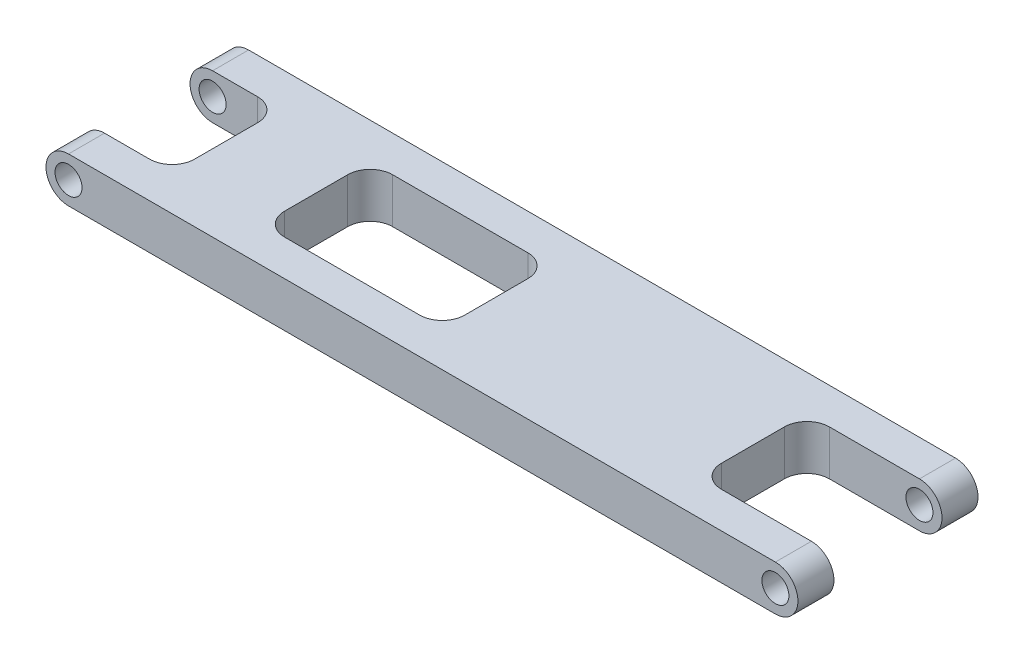
ISO-10303-21;
HEADER;
FILE_DESCRIPTION(('STEP AP214'),'2;1');
FILE_NAME('part.step','',(''),(''),'','','');
FILE_SCHEMA(('AUTOMOTIVE_DESIGN { 1 0 10303 214 1 1 1 1 }'));
ENDSEC;
DATA;
#1=APPLICATION_CONTEXT('core data for automotive mechanical design processes');
#2=APPLICATION_PROTOCOL_DEFINITION('international standard','automotive_design',2000,#1);
#3=PRODUCT_CONTEXT('',#1,'mechanical');
#4=PRODUCT('Part','Part','',(#3));
#5=PRODUCT_RELATED_PRODUCT_CATEGORY('part','',(#4));
#6=PRODUCT_DEFINITION_FORMATION('','',#4);
#7=PRODUCT_DEFINITION_CONTEXT('part definition',#1,'design');
#8=PRODUCT_DEFINITION('design','',#6,#7);
#9=PRODUCT_DEFINITION_SHAPE('','',#8);
#10=(LENGTH_UNIT() NAMED_UNIT(*) SI_UNIT(.MILLI.,.METRE.));
#11=(NAMED_UNIT(*) PLANE_ANGLE_UNIT() SI_UNIT($,.RADIAN.));
#12=(NAMED_UNIT(*) SI_UNIT($,.STERADIAN.) SOLID_ANGLE_UNIT());
#13=UNCERTAINTY_MEASURE_WITH_UNIT(LENGTH_MEASURE(1.E-05),#10,'distance_accuracy_value','');
#14=(GEOMETRIC_REPRESENTATION_CONTEXT(3) GLOBAL_UNCERTAINTY_ASSIGNED_CONTEXT((#13)) GLOBAL_UNIT_ASSIGNED_CONTEXT((#10,
#11,#12)) REPRESENTATION_CONTEXT('',''));
#15=CARTESIAN_POINT('',(0.,0.,0.));
#16=DIRECTION('',(0.,0.,1.));
#17=DIRECTION('',(1.,0.,0.));
#18=AXIS2_PLACEMENT_3D('',#15,#16,#17);
#19=CARTESIAN_POINT('',(0.,28.,10.));
#20=DIRECTION('',(0.,0.,-1.));
#21=DIRECTION('',(-1.,0.,0.));
#22=AXIS2_PLACEMENT_3D('',#19,#20,#21);
#23=CYLINDRICAL_SURFACE('',#22,2.5);
#24=CARTESIAN_POINT('',(0.,28.,6.));
#25=DIRECTION('',(0.,0.,-1.));
#26=DIRECTION('',(-1.,0.,0.));
#27=AXIS2_PLACEMENT_3D('',#24,#25,#26);
#28=CIRCLE('',#27,2.5);
#29=CARTESIAN_POINT('',(0.,25.5,6.));
#30=VERTEX_POINT('',#29);
#31=CARTESIAN_POINT('',(0.,30.5,6.));
#32=VERTEX_POINT('',#31);
#33=EDGE_CURVE('E210',#30,#32,#28,.T.);
#34=ORIENTED_EDGE('',*,*,#33,.F.);
#35=DIRECTION('',(0.,0.,-1.));
#36=VECTOR('',#35,1.);
#37=CARTESIAN_POINT('',(0.,25.5,10.));
#38=LINE('',#37,#36);
#39=CARTESIAN_POINT('',(0.,25.5,10.));
#40=VERTEX_POINT('',#39);
#41=EDGE_CURVE('E11',#40,#30,#38,.T.);
#42=ORIENTED_EDGE('',*,*,#41,.F.);
#43=CARTESIAN_POINT('',(0.,28.,10.));
#44=DIRECTION('',(0.,0.,1.));
#45=DIRECTION('',(1.,0.,0.));
#46=AXIS2_PLACEMENT_3D('',#43,#44,#45);
#47=CIRCLE('',#46,2.5);
#48=CARTESIAN_POINT('',(0.,30.5,10.));
#49=VERTEX_POINT('',#48);
#50=EDGE_CURVE('E368',#49,#40,#47,.T.);
#51=ORIENTED_EDGE('',*,*,#50,.F.);
#52=DIRECTION('',(0.,0.,-1.));
#53=VECTOR('',#52,1.);
#54=CARTESIAN_POINT('',(0.,30.5,10.));
#55=LINE('',#54,#53);
#56=EDGE_CURVE('E389',#49,#32,#55,.T.);
#57=ORIENTED_EDGE('',*,*,#56,.T.);
#58=EDGE_LOOP('',(#34,#42,#51,#57));
#59=FACE_BOUND('',#58,.T.);
#60=ADVANCED_FACE('F41',(#59),#23,.T.);
#61=CARTESIAN_POINT('',(0.,28.,-6.));
#62=DIRECTION('',(0.,0.,1.));
#63=DIRECTION('',(1.,0.,0.));
#64=AXIS2_PLACEMENT_3D('',#61,#62,#63);
#65=CIRCLE('',#64,2.5);
#66=CARTESIAN_POINT('',(0.,30.5,-6.));
#67=VERTEX_POINT('',#66);
#68=CARTESIAN_POINT('',(0.,25.5,-6.));
#69=VERTEX_POINT('',#68);
#70=EDGE_CURVE('E323',#67,#69,#65,.T.);
#71=ORIENTED_EDGE('',*,*,#70,.F.);
#72=CARTESIAN_POINT('',(0.,30.5,-10.));
#73=VERTEX_POINT('',#72);
#74=EDGE_CURVE('E378',#67,#73,#55,.T.);
#75=ORIENTED_EDGE('',*,*,#74,.T.);
#76=CARTESIAN_POINT('',(0.,28.,-10.));
#77=DIRECTION('',(0.,0.,1.));
#78=DIRECTION('',(1.,0.,0.));
#79=AXIS2_PLACEMENT_3D('',#76,#77,#78);
#80=CIRCLE('',#79,2.5);
#81=CARTESIAN_POINT('',(0.,25.5,-10.));
#82=VERTEX_POINT('',#81);
#83=EDGE_CURVE('E365',#73,#82,#80,.T.);
#84=ORIENTED_EDGE('',*,*,#83,.T.);
#85=EDGE_CURVE('E49',#69,#82,#38,.T.);
#86=ORIENTED_EDGE('',*,*,#85,.F.);
#87=EDGE_LOOP('',(#71,#75,#84,#86));
#88=FACE_BOUND('',#87,.T.);
#89=ADVANCED_FACE('F423',(#88),#23,.T.);
#90=CARTESIAN_POINT('',(0.,25.5,10.));
#91=DIRECTION('',(0.,1.,0.));
#92=DIRECTION('',(0.,0.,1.));
#93=AXIS2_PLACEMENT_3D('',#90,#91,#92);
#94=PLANE('',#93);
#95=CARTESIAN_POINT('',(35.,25.5,3.49999999999999));
#96=DIRECTION('',(0.,1.,0.));
#97=DIRECTION('',(0.,0.,1.));
#98=AXIS2_PLACEMENT_3D('',#95,#96,#97);
#99=CIRCLE('',#98,2.5);
#100=CARTESIAN_POINT('',(37.5,25.5,3.49999999999999));
#101=VERTEX_POINT('',#100);
#102=CARTESIAN_POINT('',(35.,25.5,5.99999999999999));
#103=VERTEX_POINT('',#102);
#104=EDGE_CURVE('E342',#101,#103,#99,.F.);
#105=ORIENTED_EDGE('',*,*,#104,.F.);
#106=DIRECTION('',(0.,0.,1.));
#107=VECTOR('',#106,1.);
#108=CARTESIAN_POINT('',(37.5,25.5,10.));
#109=LINE('',#108,#107);
#110=CARTESIAN_POINT('',(37.5,25.5,-3.50000000000001));
#111=VERTEX_POINT('',#110);
#112=EDGE_CURVE('E340',#111,#101,#109,.T.);
#113=ORIENTED_EDGE('',*,*,#112,.F.);
#114=CARTESIAN_POINT('',(35.,25.5,-3.5));
#115=DIRECTION('',(0.,1.,0.));
#116=DIRECTION('',(0.,0.,1.));
#117=AXIS2_PLACEMENT_3D('',#114,#115,#116);
#118=CIRCLE('',#117,2.5);
#119=CARTESIAN_POINT('',(35.,25.5,-6.));
#120=VERTEX_POINT('',#119);
#121=EDGE_CURVE('E338',#120,#111,#118,.F.);
#122=ORIENTED_EDGE('',*,*,#121,.F.);
#123=DIRECTION('',(1.,0.,0.));
#124=VECTOR('',#123,1.);
#125=CARTESIAN_POINT('',(0.,25.5,-6.00000000000001));
#126=LINE('',#125,#124);
#127=CARTESIAN_POINT('',(20.,25.5,-6.));
#128=VERTEX_POINT('',#127);
#129=EDGE_CURVE('E336',#128,#120,#126,.T.);
#130=ORIENTED_EDGE('',*,*,#129,.F.);
#131=CARTESIAN_POINT('',(20.,25.5,-3.5));
#132=DIRECTION('',(0.,1.,0.));
#133=DIRECTION('',(0.,0.,1.));
#134=AXIS2_PLACEMENT_3D('',#131,#132,#133);
#135=CIRCLE('',#134,2.5);
#136=CARTESIAN_POINT('',(17.5,25.5,-3.5));
#137=VERTEX_POINT('',#136);
#138=EDGE_CURVE('E334',#137,#128,#135,.F.);
#139=ORIENTED_EDGE('',*,*,#138,.F.);
#140=DIRECTION('',(0.,0.,-1.));
#141=VECTOR('',#140,1.);
#142=CARTESIAN_POINT('',(17.5,25.5,9.99999999999999));
#143=LINE('',#142,#141);
#144=CARTESIAN_POINT('',(17.5,25.5,3.49999999999999));
#145=VERTEX_POINT('',#144);
#146=EDGE_CURVE('E332',#145,#137,#143,.T.);
#147=ORIENTED_EDGE('',*,*,#146,.F.);
#148=CARTESIAN_POINT('',(20.,25.5,3.49999999999999));
#149=DIRECTION('',(0.,1.,0.));
#150=DIRECTION('',(0.,0.,1.));
#151=AXIS2_PLACEMENT_3D('',#148,#149,#150);
#152=CIRCLE('',#151,2.5);
#153=CARTESIAN_POINT('',(20.,25.5,5.99999999999999));
#154=VERTEX_POINT('',#153);
#155=EDGE_CURVE('E330',#154,#145,#152,.F.);
#156=ORIENTED_EDGE('',*,*,#155,.F.);
#157=DIRECTION('',(-1.,0.,0.));
#158=VECTOR('',#157,1.);
#159=CARTESIAN_POINT('',(0.,25.5,5.99999999999999));
#160=LINE('',#159,#158);
#161=EDGE_CURVE('E328',#103,#154,#160,.T.);
#162=ORIENTED_EDGE('',*,*,#161,.F.);
#163=EDGE_LOOP('',(#105,#113,#122,#130,#139,#147,#156,#162));
#164=FACE_BOUND('',#163,.T.);
#165=DIRECTION('',(-1.,0.,0.));
#166=VECTOR('',#165,1.);
#167=CARTESIAN_POINT('',(0.,25.5,6.));
#168=LINE('',#167,#166);
#169=CARTESIAN_POINT('',(5.,25.5,6.));
#170=VERTEX_POINT('',#169);
#171=EDGE_CURVE('E325',#170,#30,#168,.T.);
#172=ORIENTED_EDGE('',*,*,#171,.F.);
#173=CARTESIAN_POINT('',(5.,25.5,3.5));
#174=DIRECTION('',(0.,1.,0.));
#175=DIRECTION('',(0.,0.,1.));
#176=AXIS2_PLACEMENT_3D('',#173,#174,#175);
#177=CIRCLE('',#176,2.5);
#178=CARTESIAN_POINT('',(7.5,25.5,3.5));
#179=VERTEX_POINT('',#178);
#180=EDGE_CURVE('E224',#179,#170,#177,.F.);
#181=ORIENTED_EDGE('',*,*,#180,.F.);
#182=DIRECTION('',(0.,0.,1.));
#183=VECTOR('',#182,1.);
#184=CARTESIAN_POINT('',(7.5,25.5,10.));
#185=LINE('',#184,#183);
#186=CARTESIAN_POINT('',(7.5,25.5,-3.5));
#187=VERTEX_POINT('',#186);
#188=EDGE_CURVE('E352',#187,#179,#185,.T.);
#189=ORIENTED_EDGE('',*,*,#188,.F.);
#190=CARTESIAN_POINT('',(5.,25.5,-3.5));
#191=DIRECTION('',(0.,1.,0.));
#192=DIRECTION('',(0.,0.,1.));
#193=AXIS2_PLACEMENT_3D('',#190,#191,#192);
#194=CIRCLE('',#193,2.5);
#195=CARTESIAN_POINT('',(5.,25.5,-6.));
#196=VERTEX_POINT('',#195);
#197=EDGE_CURVE('E350',#196,#187,#194,.F.);
#198=ORIENTED_EDGE('',*,*,#197,.F.);
#199=DIRECTION('',(1.,0.,0.));
#200=VECTOR('',#199,1.);
#201=CARTESIAN_POINT('',(0.,25.5,-6.));
#202=LINE('',#201,#200);
#203=EDGE_CURVE('E321',#69,#196,#202,.T.);
#204=ORIENTED_EDGE('',*,*,#203,.F.);
#205=ORIENTED_EDGE('',*,*,#85,.T.);
#206=DIRECTION('',(1.,0.,0.));
#207=VECTOR('',#206,1.);
#208=CARTESIAN_POINT('',(0.,25.5,-10.));
#209=LINE('',#208,#207);
#210=CARTESIAN_POINT('',(78.5,25.5,-10.));
#211=VERTEX_POINT('',#210);
#212=EDGE_CURVE('E381',#82,#211,#209,.T.);
#213=ORIENTED_EDGE('',*,*,#212,.T.);
#214=DIRECTION('',(0.,0.,-1.));
#215=VECTOR('',#214,1.);
#216=CARTESIAN_POINT('',(78.5,25.5,10.));
#217=LINE('',#216,#215);
#218=CARTESIAN_POINT('',(78.5,25.5,-5.99999999999998));
#219=VERTEX_POINT('',#218);
#220=EDGE_CURVE('E395',#219,#211,#217,.T.);
#221=ORIENTED_EDGE('',*,*,#220,.F.);
#222=DIRECTION('',(1.,0.,0.));
#223=VECTOR('',#222,1.);
#224=CARTESIAN_POINT('',(0.,25.5,-6.00000000000023));
#225=LINE('',#224,#223);
#226=CARTESIAN_POINT('',(68.5,25.5,-6.00000000000002));
#227=VERTEX_POINT('',#226);
#228=EDGE_CURVE('E318',#227,#219,#225,.T.);
#229=ORIENTED_EDGE('',*,*,#228,.F.);
#230=CARTESIAN_POINT('',(68.5,25.5,-3.50000000000002));
#231=DIRECTION('',(0.,1.,0.));
#232=DIRECTION('',(0.,0.,1.));
#233=AXIS2_PLACEMENT_3D('',#230,#231,#232);
#234=CIRCLE('',#233,2.5);
#235=CARTESIAN_POINT('',(66.,25.5,-3.50000000000002));
#236=VERTEX_POINT('',#235);
#237=EDGE_CURVE('E348',#236,#227,#234,.F.);
#238=ORIENTED_EDGE('',*,*,#237,.F.);
#239=DIRECTION('',(0.,0.,-1.));
#240=VECTOR('',#239,1.);
#241=CARTESIAN_POINT('',(66.,25.5,10.));
#242=LINE('',#241,#240);
#243=CARTESIAN_POINT('',(66.,25.5,3.50000000000002));
#244=VERTEX_POINT('',#243);
#245=EDGE_CURVE('E346',#244,#236,#242,.T.);
#246=ORIENTED_EDGE('',*,*,#245,.F.);
#247=CARTESIAN_POINT('',(68.5,25.5,3.50000000000002));
#248=DIRECTION('',(0.,1.,0.));
#249=DIRECTION('',(0.,0.,1.));
#250=AXIS2_PLACEMENT_3D('',#247,#248,#249);
#251=CIRCLE('',#250,2.5);
#252=CARTESIAN_POINT('',(68.5,25.5,6.00000000000002));
#253=VERTEX_POINT('',#252);
#254=EDGE_CURVE('E344',#253,#244,#251,.F.);
#255=ORIENTED_EDGE('',*,*,#254,.F.);
#256=DIRECTION('',(-1.,0.,0.));
#257=VECTOR('',#256,1.);
#258=CARTESIAN_POINT('',(0.,25.5,6.00000000000023));
#259=LINE('',#258,#257);
#260=CARTESIAN_POINT('',(78.5,25.5,5.99999999999999));
#261=VERTEX_POINT('',#260);
#262=EDGE_CURVE('E313',#261,#253,#259,.T.);
#263=ORIENTED_EDGE('',*,*,#262,.F.);
#264=CARTESIAN_POINT('',(78.5,25.5,10.));
#265=VERTEX_POINT('',#264);
#266=EDGE_CURVE('E396',#265,#261,#217,.T.);
#267=ORIENTED_EDGE('',*,*,#266,.F.);
#268=DIRECTION('',(1.,0.,0.));
#269=VECTOR('',#268,1.);
#270=CARTESIAN_POINT('',(0.,25.5,10.));
#271=LINE('',#270,#269);
#272=EDGE_CURVE('E371',#40,#265,#271,.T.);
#273=ORIENTED_EDGE('',*,*,#272,.F.);
#274=ORIENTED_EDGE('',*,*,#41,.T.);
#275=EDGE_LOOP('',(#172,#181,#189,#198,#204,#205,#213,#221,#229,#238,#246,#255,#263,#267,#273,#274));
#276=FACE_BOUND('',#275,.T.);
#277=ADVANCED_FACE('F420',(#164,#276),#94,.F.);
#278=CARTESIAN_POINT('',(78.5,28.,10.));
#279=DIRECTION('',(0.,0.,-1.));
#280=DIRECTION('',(-1.,0.,0.));
#281=AXIS2_PLACEMENT_3D('',#278,#279,#280);
#282=CYLINDRICAL_SURFACE('',#281,2.5);
#283=DIRECTION('',(0.,0.,-1.));
#284=VECTOR('',#283,1.);
#285=CARTESIAN_POINT('',(78.5,30.5,10.));
#286=LINE('',#285,#284);
#287=CARTESIAN_POINT('',(78.5,30.5,-5.99999999999999));
#288=VERTEX_POINT('',#287);
#289=CARTESIAN_POINT('',(78.5,30.5,-10.));
#290=VERTEX_POINT('',#289);
#291=EDGE_CURVE('E391',#288,#290,#286,.T.);
#292=ORIENTED_EDGE('',*,*,#291,.F.);
#293=CARTESIAN_POINT('',(78.5,28.,-5.99999999999998));
#294=DIRECTION('',(0.,0.,1.));
#295=DIRECTION('',(1.,0.,0.));
#296=AXIS2_PLACEMENT_3D('',#293,#294,#295);
#297=CIRCLE('',#296,2.5);
#298=EDGE_CURVE('E316',#219,#288,#297,.T.);
#299=ORIENTED_EDGE('',*,*,#298,.F.);
#300=ORIENTED_EDGE('',*,*,#220,.T.);
#301=CARTESIAN_POINT('',(78.5,28.,-10.));
#302=DIRECTION('',(0.,0.,1.));
#303=DIRECTION('',(1.,0.,0.));
#304=AXIS2_PLACEMENT_3D('',#301,#302,#303);
#305=CIRCLE('',#304,2.5);
#306=EDGE_CURVE('E384',#211,#290,#305,.T.);
#307=ORIENTED_EDGE('',*,*,#306,.T.);
#308=EDGE_LOOP('',(#292,#299,#300,#307));
#309=FACE_BOUND('',#308,.T.);
#310=ADVANCED_FACE('F436',(#309),#282,.T.);
#311=CARTESIAN_POINT('',(78.5,28.,5.99999999999999));
#312=DIRECTION('',(0.,0.,-1.));
#313=DIRECTION('',(-1.,0.,0.));
#314=AXIS2_PLACEMENT_3D('',#311,#312,#313);
#315=CIRCLE('',#314,2.5);
#316=CARTESIAN_POINT('',(78.5,30.5,5.99999999999999));
#317=VERTEX_POINT('',#316);
#318=EDGE_CURVE('E311',#317,#261,#315,.T.);
#319=ORIENTED_EDGE('',*,*,#318,.F.);
#320=CARTESIAN_POINT('',(78.5,30.5,10.));
#321=VERTEX_POINT('',#320);
#322=EDGE_CURVE('E392',#321,#317,#286,.T.);
#323=ORIENTED_EDGE('',*,*,#322,.F.);
#324=CARTESIAN_POINT('',(78.5,28.,10.));
#325=DIRECTION('',(0.,0.,1.));
#326=DIRECTION('',(1.,0.,0.));
#327=AXIS2_PLACEMENT_3D('',#324,#325,#326);
#328=CIRCLE('',#327,2.5);
#329=EDGE_CURVE('E374',#265,#321,#328,.T.);
#330=ORIENTED_EDGE('',*,*,#329,.F.);
#331=ORIENTED_EDGE('',*,*,#266,.T.);
#332=EDGE_LOOP('',(#319,#323,#330,#331));
#333=FACE_BOUND('',#332,.T.);
#334=ADVANCED_FACE('F461',(#333),#282,.T.);
#335=CARTESIAN_POINT('',(0.,30.5,10.));
#336=DIRECTION('',(0.,-1.,0.));
#337=DIRECTION('',(0.,0.,-1.));
#338=AXIS2_PLACEMENT_3D('',#335,#336,#337);
#339=PLANE('',#338);
#340=CARTESIAN_POINT('',(35.,30.5,3.49999999999999));
#341=DIRECTION('',(0.,1.,0.));
#342=DIRECTION('',(0.,0.,1.));
#343=AXIS2_PLACEMENT_3D('',#340,#341,#342);
#344=CIRCLE('',#343,2.5);
#345=CARTESIAN_POINT('',(35.,30.5,5.99999999999999));
#346=VERTEX_POINT('',#345);
#347=CARTESIAN_POINT('',(37.5,30.5,3.49999999999999));
#348=VERTEX_POINT('',#347);
#349=EDGE_CURVE('E247',#346,#348,#344,.T.);
#350=ORIENTED_EDGE('',*,*,#349,.F.);
#351=DIRECTION('',(1.,0.,0.));
#352=VECTOR('',#351,1.);
#353=CARTESIAN_POINT('',(20.,30.5,5.99999999999999));
#354=LINE('',#353,#352);
#355=CARTESIAN_POINT('',(20.,30.5,5.99999999999999));
#356=VERTEX_POINT('',#355);
#357=EDGE_CURVE('E290',#356,#346,#354,.T.);
#358=ORIENTED_EDGE('',*,*,#357,.F.);
#359=CARTESIAN_POINT('',(20.,30.5,3.49999999999999));
#360=DIRECTION('',(0.,1.,0.));
#361=DIRECTION('',(0.,0.,1.));
#362=AXIS2_PLACEMENT_3D('',#359,#360,#361);
#363=CIRCLE('',#362,2.5);
#364=CARTESIAN_POINT('',(17.5,30.5,3.49999999999999));
#365=VERTEX_POINT('',#364);
#366=EDGE_CURVE('E292',#365,#356,#363,.T.);
#367=ORIENTED_EDGE('',*,*,#366,.F.);
#368=DIRECTION('',(0.,0.,1.));
#369=VECTOR('',#368,1.);
#370=CARTESIAN_POINT('',(17.5,30.5,-3.5));
#371=LINE('',#370,#369);
#372=CARTESIAN_POINT('',(17.5,30.5,-3.5));
#373=VERTEX_POINT('',#372);
#374=EDGE_CURVE('E294',#373,#365,#371,.T.);
#375=ORIENTED_EDGE('',*,*,#374,.F.);
#376=CARTESIAN_POINT('',(20.,30.5,-3.5));
#377=DIRECTION('',(0.,1.,0.));
#378=DIRECTION('',(0.,0.,1.));
#379=AXIS2_PLACEMENT_3D('',#376,#377,#378);
#380=CIRCLE('',#379,2.5);
#381=CARTESIAN_POINT('',(20.,30.5,-6.));
#382=VERTEX_POINT('',#381);
#383=EDGE_CURVE('E297',#382,#373,#380,.T.);
#384=ORIENTED_EDGE('',*,*,#383,.F.);
#385=DIRECTION('',(-1.,0.,0.));
#386=VECTOR('',#385,1.);
#387=CARTESIAN_POINT('',(20.,30.5,-6.));
#388=LINE('',#387,#386);
#389=CARTESIAN_POINT('',(35.,30.5,-6.));
#390=VERTEX_POINT('',#389);
#391=EDGE_CURVE('E300',#390,#382,#388,.T.);
#392=ORIENTED_EDGE('',*,*,#391,.F.);
#393=CARTESIAN_POINT('',(35.,30.5,-3.5));
#394=DIRECTION('',(0.,1.,0.));
#395=DIRECTION('',(0.,0.,-1.));
#396=AXIS2_PLACEMENT_3D('',#393,#394,#395);
#397=CIRCLE('',#396,2.5);
#398=CARTESIAN_POINT('',(37.5,30.5,-3.50000000000001));
#399=VERTEX_POINT('',#398);
#400=EDGE_CURVE('E303',#399,#390,#397,.T.);
#401=ORIENTED_EDGE('',*,*,#400,.F.);
#402=DIRECTION('',(0.,0.,-1.));
#403=VECTOR('',#402,1.);
#404=CARTESIAN_POINT('',(37.5,30.5,-3.5));
#405=LINE('',#404,#403);
#406=EDGE_CURVE('E306',#348,#399,#405,.T.);
#407=ORIENTED_EDGE('',*,*,#406,.F.);
#408=EDGE_LOOP('',(#350,#358,#367,#375,#384,#392,#401,#407));
#409=FACE_BOUND('',#408,.T.);
#410=DIRECTION('',(1.,0.,0.));
#411=VECTOR('',#410,1.);
#412=CARTESIAN_POINT('',(-2.5,30.5,6.));
#413=LINE('',#412,#411);
#414=CARTESIAN_POINT('',(5.,30.5,6.));
#415=VERTEX_POINT('',#414);
#416=EDGE_CURVE('E204',#32,#415,#413,.T.);
#417=ORIENTED_EDGE('',*,*,#416,.F.);
#418=ORIENTED_EDGE('',*,*,#56,.F.);
#419=DIRECTION('',(-1.,0.,0.));
#420=VECTOR('',#419,1.);
#421=CARTESIAN_POINT('',(0.,30.5,10.));
#422=LINE('',#421,#420);
#423=EDGE_CURVE('E376',#321,#49,#422,.T.);
#424=ORIENTED_EDGE('',*,*,#423,.F.);
#425=ORIENTED_EDGE('',*,*,#322,.T.);
#426=DIRECTION('',(1.,0.,0.));
#427=VECTOR('',#426,1.);
#428=CARTESIAN_POINT('',(81.,30.5,5.99999999999998));
#429=LINE('',#428,#427);
#430=CARTESIAN_POINT('',(68.5,30.5,6.00000000000002));
#431=VERTEX_POINT('',#430);
#432=EDGE_CURVE('E256',#431,#317,#429,.T.);
#433=ORIENTED_EDGE('',*,*,#432,.F.);
#434=CARTESIAN_POINT('',(68.5,30.5,3.50000000000002));
#435=DIRECTION('',(0.,1.,0.));
#436=DIRECTION('',(0.,0.,-1.));
#437=AXIS2_PLACEMENT_3D('',#434,#435,#436);
#438=CIRCLE('',#437,2.5);
#439=CARTESIAN_POINT('',(66.,30.5,3.50000000000002));
#440=VERTEX_POINT('',#439);
#441=EDGE_CURVE('E259',#440,#431,#438,.T.);
#442=ORIENTED_EDGE('',*,*,#441,.F.);
#443=DIRECTION('',(0.,0.,1.));
#444=VECTOR('',#443,1.);
#445=CARTESIAN_POINT('',(66.,30.5,-3.50000000000002));
#446=LINE('',#445,#444);
#447=CARTESIAN_POINT('',(66.,30.5,-3.50000000000002));
#448=VERTEX_POINT('',#447);
#449=EDGE_CURVE('E261',#448,#440,#446,.T.);
#450=ORIENTED_EDGE('',*,*,#449,.F.);
#451=CARTESIAN_POINT('',(68.5,30.5,-3.50000000000002));
#452=DIRECTION('',(0.,1.,0.));
#453=DIRECTION('',(0.,0.,1.));
#454=AXIS2_PLACEMENT_3D('',#451,#452,#453);
#455=CIRCLE('',#454,2.5);
#456=CARTESIAN_POINT('',(68.5,30.5,-6.00000000000002));
#457=VERTEX_POINT('',#456);
#458=EDGE_CURVE('E264',#457,#448,#455,.T.);
#459=ORIENTED_EDGE('',*,*,#458,.F.);
#460=DIRECTION('',(-1.,0.,0.));
#461=VECTOR('',#460,1.);
#462=CARTESIAN_POINT('',(81.,30.5,-5.99999999999998));
#463=LINE('',#462,#461);
#464=EDGE_CURVE('E216',#288,#457,#463,.T.);
#465=ORIENTED_EDGE('',*,*,#464,.F.);
#466=ORIENTED_EDGE('',*,*,#291,.T.);
#467=DIRECTION('',(-1.,0.,0.));
#468=VECTOR('',#467,1.);
#469=CARTESIAN_POINT('',(0.,30.5,-10.));
#470=LINE('',#469,#468);
#471=EDGE_CURVE('E372',#290,#73,#470,.T.);
#472=ORIENTED_EDGE('',*,*,#471,.T.);
#473=ORIENTED_EDGE('',*,*,#74,.F.);
#474=DIRECTION('',(-1.,0.,0.));
#475=VECTOR('',#474,1.);
#476=CARTESIAN_POINT('',(-2.5,30.5,-6.));
#477=LINE('',#476,#475);
#478=CARTESIAN_POINT('',(5.,30.5,-6.));
#479=VERTEX_POINT('',#478);
#480=EDGE_CURVE('E235',#479,#67,#477,.T.);
#481=ORIENTED_EDGE('',*,*,#480,.F.);
#482=CARTESIAN_POINT('',(5.,30.5,-3.5));
#483=DIRECTION('',(0.,1.,0.));
#484=DIRECTION('',(0.,0.,-1.));
#485=AXIS2_PLACEMENT_3D('',#482,#483,#484);
#486=CIRCLE('',#485,2.5);
#487=CARTESIAN_POINT('',(7.5,30.5,-3.5));
#488=VERTEX_POINT('',#487);
#489=EDGE_CURVE('E65',#488,#479,#486,.T.);
#490=ORIENTED_EDGE('',*,*,#489,.F.);
#491=DIRECTION('',(0.,0.,-1.));
#492=VECTOR('',#491,1.);
#493=CARTESIAN_POINT('',(7.5,30.5,-3.5));
#494=LINE('',#493,#492);
#495=CARTESIAN_POINT('',(7.5,30.5,3.5));
#496=VERTEX_POINT('',#495);
#497=EDGE_CURVE('E230',#496,#488,#494,.T.);
#498=ORIENTED_EDGE('',*,*,#497,.F.);
#499=CARTESIAN_POINT('',(5.,30.5,3.5));
#500=DIRECTION('',(0.,1.,0.));
#501=DIRECTION('',(0.,0.,1.));
#502=AXIS2_PLACEMENT_3D('',#499,#500,#501);
#503=CIRCLE('',#502,2.5);
#504=EDGE_CURVE('E215',#415,#496,#503,.T.);
#505=ORIENTED_EDGE('',*,*,#504,.F.);
#506=EDGE_LOOP('',(#417,#418,#424,#425,#433,#442,#450,#459,#465,#466,#472,#473,#481,#490,#498,#505));
#507=FACE_BOUND('',#506,.T.);
#508=ADVANCED_FACE('F228',(#409,#507),#339,.F.);
#509=CARTESIAN_POINT('',(0.,28.,10.));
#510=DIRECTION('',(0.,0.,-1.));
#511=DIRECTION('',(-1.,0.,0.));
#512=AXIS2_PLACEMENT_3D('',#509,#510,#511);
#513=CYLINDRICAL_SURFACE('',#512,1.5);
#514=CARTESIAN_POINT('',(0.,28.,10.));
#515=DIRECTION('',(0.,0.,1.));
#516=DIRECTION('',(1.,0.,0.));
#517=AXIS2_PLACEMENT_3D('',#514,#515,#516);
#518=CIRCLE('',#517,1.5);
#519=CARTESIAN_POINT('',(1.5,28.,10.));
#520=VERTEX_POINT('',#519);
#521=EDGE_CURVE('E362',#520,#520,#518,.T.);
#522=ORIENTED_EDGE('',*,*,#521,.T.);
#523=EDGE_LOOP('',(#522));
#524=FACE_BOUND('',#523,.T.);
#525=CARTESIAN_POINT('',(0.,28.,6.));
#526=DIRECTION('',(0.,0.,-1.));
#527=DIRECTION('',(-1.,0.,0.));
#528=AXIS2_PLACEMENT_3D('',#525,#526,#527);
#529=CIRCLE('',#528,1.5);
#530=CARTESIAN_POINT('',(-1.5,28.,6.));
#531=VERTEX_POINT('',#530);
#532=EDGE_CURVE('E44',#531,#531,#529,.T.);
#533=ORIENTED_EDGE('',*,*,#532,.T.);
#534=EDGE_LOOP('',(#533));
#535=FACE_BOUND('',#534,.T.);
#536=ADVANCED_FACE('F498',(#524,#535),#513,.F.);
#537=CARTESIAN_POINT('',(0.,28.,-10.));
#538=DIRECTION('',(0.,0.,1.));
#539=DIRECTION('',(1.,0.,0.));
#540=AXIS2_PLACEMENT_3D('',#537,#538,#539);
#541=CIRCLE('',#540,1.5);
#542=CARTESIAN_POINT('',(1.5,28.,-10.));
#543=VERTEX_POINT('',#542);
#544=EDGE_CURVE('E359',#543,#543,#541,.T.);
#545=ORIENTED_EDGE('',*,*,#544,.F.);
#546=EDGE_LOOP('',(#545));
#547=FACE_BOUND('',#546,.T.);
#548=CARTESIAN_POINT('',(0.,28.,-6.));
#549=DIRECTION('',(0.,0.,1.));
#550=DIRECTION('',(1.,0.,0.));
#551=AXIS2_PLACEMENT_3D('',#548,#549,#550);
#552=CIRCLE('',#551,1.5);
#553=CARTESIAN_POINT('',(1.5,28.,-6.));
#554=VERTEX_POINT('',#553);
#555=EDGE_CURVE('E320',#554,#554,#552,.T.);
#556=ORIENTED_EDGE('',*,*,#555,.T.);
#557=EDGE_LOOP('',(#556));
#558=FACE_BOUND('',#557,.T.);
#559=ADVANCED_FACE('F405',(#547,#558),#513,.F.);
#560=CARTESIAN_POINT('',(78.5,28.,10.));
#561=DIRECTION('',(0.,0.,-1.));
#562=DIRECTION('',(-1.,0.,0.));
#563=AXIS2_PLACEMENT_3D('',#560,#561,#562);
#564=CYLINDRICAL_SURFACE('',#563,1.5);
#565=CARTESIAN_POINT('',(78.5,28.,-10.));
#566=DIRECTION('',(0.,0.,1.));
#567=DIRECTION('',(1.,0.,0.));
#568=AXIS2_PLACEMENT_3D('',#565,#566,#567);
#569=CIRCLE('',#568,1.5);
#570=CARTESIAN_POINT('',(80.,28.,-10.));
#571=VERTEX_POINT('',#570);
#572=EDGE_CURVE('E355',#571,#571,#569,.T.);
#573=ORIENTED_EDGE('',*,*,#572,.F.);
#574=EDGE_LOOP('',(#573));
#575=FACE_BOUND('',#574,.T.);
#576=CARTESIAN_POINT('',(78.5,28.,-5.99999999999998));
#577=DIRECTION('',(0.,0.,1.));
#578=DIRECTION('',(1.,0.,0.));
#579=AXIS2_PLACEMENT_3D('',#576,#577,#578);
#580=CIRCLE('',#579,1.5);
#581=CARTESIAN_POINT('',(80.,28.,-5.99999999999998));
#582=VERTEX_POINT('',#581);
#583=EDGE_CURVE('E315',#582,#582,#580,.T.);
#584=ORIENTED_EDGE('',*,*,#583,.T.);
#585=EDGE_LOOP('',(#584));
#586=FACE_BOUND('',#585,.T.);
#587=ADVANCED_FACE('F508',(#575,#586),#564,.F.);
#588=CARTESIAN_POINT('',(78.5,28.,10.));
#589=DIRECTION('',(0.,0.,1.));
#590=DIRECTION('',(1.,0.,0.));
#591=AXIS2_PLACEMENT_3D('',#588,#589,#590);
#592=CIRCLE('',#591,1.5);
#593=CARTESIAN_POINT('',(80.,28.,10.));
#594=VERTEX_POINT('',#593);
#595=EDGE_CURVE('E356',#594,#594,#592,.T.);
#596=ORIENTED_EDGE('',*,*,#595,.T.);
#597=EDGE_LOOP('',(#596));
#598=FACE_BOUND('',#597,.T.);
#599=CARTESIAN_POINT('',(78.5,28.,5.99999999999999));
#600=DIRECTION('',(0.,0.,-1.));
#601=DIRECTION('',(-1.,0.,0.));
#602=AXIS2_PLACEMENT_3D('',#599,#600,#601);
#603=CIRCLE('',#602,1.5);
#604=CARTESIAN_POINT('',(77.,28.,5.99999999999999));
#605=VERTEX_POINT('',#604);
#606=EDGE_CURVE('E225',#605,#605,#603,.T.);
#607=ORIENTED_EDGE('',*,*,#606,.T.);
#608=EDGE_LOOP('',(#607));
#609=FACE_BOUND('',#608,.T.);
#610=ADVANCED_FACE('F503',(#598,#609),#564,.F.);
#611=CARTESIAN_POINT('',(0.,28.,10.));
#612=DIRECTION('',(0.,0.,1.));
#613=DIRECTION('',(1.,0.,0.));
#614=AXIS2_PLACEMENT_3D('',#611,#612,#613);
#615=PLANE('',#614);
#616=ORIENTED_EDGE('',*,*,#521,.F.);
#617=EDGE_LOOP('',(#616));
#618=FACE_BOUND('',#617,.T.);
#619=ORIENTED_EDGE('',*,*,#50,.T.);
#620=ORIENTED_EDGE('',*,*,#272,.T.);
#621=ORIENTED_EDGE('',*,*,#329,.T.);
#622=ORIENTED_EDGE('',*,*,#423,.T.);
#623=EDGE_LOOP('',(#619,#620,#621,#622));
#624=FACE_BOUND('',#623,.T.);
#625=ORIENTED_EDGE('',*,*,#595,.F.);
#626=EDGE_LOOP('',(#625));
#627=FACE_BOUND('',#626,.T.);
#628=ADVANCED_FACE('F466',(#618,#624,#627),#615,.T.);
#629=CARTESIAN_POINT('',(0.,28.,-10.));
#630=DIRECTION('',(0.,0.,1.));
#631=DIRECTION('',(1.,0.,0.));
#632=AXIS2_PLACEMENT_3D('',#629,#630,#631);
#633=PLANE('',#632);
#634=ORIENTED_EDGE('',*,*,#83,.F.);
#635=ORIENTED_EDGE('',*,*,#471,.F.);
#636=ORIENTED_EDGE('',*,*,#306,.F.);
#637=ORIENTED_EDGE('',*,*,#212,.F.);
#638=EDGE_LOOP('',(#634,#635,#636,#637));
#639=FACE_BOUND('',#638,.T.);
#640=ORIENTED_EDGE('',*,*,#544,.T.);
#641=EDGE_LOOP('',(#640));
#642=FACE_BOUND('',#641,.T.);
#643=ORIENTED_EDGE('',*,*,#572,.T.);
#644=EDGE_LOOP('',(#643));
#645=FACE_BOUND('',#644,.T.);
#646=ADVANCED_FACE('F427',(#639,#642,#645),#633,.F.);
#647=CARTESIAN_POINT('',(68.5,25.5,-3.50000000000002));
#648=DIRECTION('',(0.,-1.,0.));
#649=DIRECTION('',(0.,0.,-1.));
#650=AXIS2_PLACEMENT_3D('',#647,#648,#649);
#651=CYLINDRICAL_SURFACE('',#650,2.5);
#652=ORIENTED_EDGE('',*,*,#237,.T.);
#653=DIRECTION('',(0.,-1.,0.));
#654=VECTOR('',#653,1.);
#655=CARTESIAN_POINT('',(68.5,25.5,-6.00000000000002));
#656=LINE('',#655,#654);
#657=EDGE_CURVE('E243',#457,#227,#656,.T.);
#658=ORIENTED_EDGE('',*,*,#657,.F.);
#659=ORIENTED_EDGE('',*,*,#458,.T.);
#660=DIRECTION('',(0.,-1.,0.));
#661=VECTOR('',#660,1.);
#662=CARTESIAN_POINT('',(66.,25.5,-3.50000000000002));
#663=LINE('',#662,#661);
#664=EDGE_CURVE('E246',#448,#236,#663,.T.);
#665=ORIENTED_EDGE('',*,*,#664,.T.);
#666=EDGE_LOOP('',(#652,#658,#659,#665));
#667=FACE_BOUND('',#666,.T.);
#668=ADVANCED_FACE('F445',(#667),#651,.F.);
#669=CARTESIAN_POINT('',(66.,25.5,-3.50000000000002));
#670=DIRECTION('',(1.,0.,0.));
#671=DIRECTION('',(0.,0.,-1.));
#672=AXIS2_PLACEMENT_3D('',#669,#670,#671);
#673=PLANE('',#672);
#674=ORIENTED_EDGE('',*,*,#245,.T.);
#675=ORIENTED_EDGE('',*,*,#664,.F.);
#676=ORIENTED_EDGE('',*,*,#449,.T.);
#677=DIRECTION('',(0.,-1.,0.));
#678=VECTOR('',#677,1.);
#679=CARTESIAN_POINT('',(66.,25.5,3.50000000000002));
#680=LINE('',#679,#678);
#681=EDGE_CURVE('E250',#440,#244,#680,.T.);
#682=ORIENTED_EDGE('',*,*,#681,.T.);
#683=EDGE_LOOP('',(#674,#675,#676,#682));
#684=FACE_BOUND('',#683,.T.);
#685=ADVANCED_FACE('F450',(#684),#673,.T.);
#686=CARTESIAN_POINT('',(68.5,25.5,3.50000000000002));
#687=DIRECTION('',(0.,-1.,0.));
#688=DIRECTION('',(0.,0.,-1.));
#689=AXIS2_PLACEMENT_3D('',#686,#687,#688);
#690=CYLINDRICAL_SURFACE('',#689,2.5);
#691=ORIENTED_EDGE('',*,*,#254,.T.);
#692=ORIENTED_EDGE('',*,*,#681,.F.);
#693=ORIENTED_EDGE('',*,*,#441,.T.);
#694=DIRECTION('',(0.,-1.,0.));
#695=VECTOR('',#694,1.);
#696=CARTESIAN_POINT('',(68.5,25.5,6.00000000000002));
#697=LINE('',#696,#695);
#698=EDGE_CURVE('E253',#431,#253,#697,.T.);
#699=ORIENTED_EDGE('',*,*,#698,.T.);
#700=EDGE_LOOP('',(#691,#692,#693,#699));
#701=FACE_BOUND('',#700,.T.);
#702=ADVANCED_FACE('F452',(#701),#690,.F.);
#703=CARTESIAN_POINT('',(81.,25.5,-5.99999999999998));
#704=DIRECTION('',(0.,0.,1.));
#705=DIRECTION('',(1.,0.,0.));
#706=AXIS2_PLACEMENT_3D('',#703,#704,#705);
#707=PLANE('',#706);
#708=ORIENTED_EDGE('',*,*,#583,.F.);
#709=EDGE_LOOP('',(#708));
#710=FACE_BOUND('',#709,.T.);
#711=ORIENTED_EDGE('',*,*,#228,.T.);
#712=ORIENTED_EDGE('',*,*,#298,.T.);
#713=ORIENTED_EDGE('',*,*,#464,.T.);
#714=ORIENTED_EDGE('',*,*,#657,.T.);
#715=EDGE_LOOP('',(#711,#712,#713,#714));
#716=FACE_BOUND('',#715,.T.);
#717=ADVANCED_FACE('F439',(#710,#716),#707,.T.);
#718=CARTESIAN_POINT('',(81.,25.5,5.99999999999998));
#719=DIRECTION('',(0.,0.,-1.));
#720=DIRECTION('',(-1.,0.,0.));
#721=AXIS2_PLACEMENT_3D('',#718,#719,#720);
#722=PLANE('',#721);
#723=ORIENTED_EDGE('',*,*,#606,.F.);
#724=EDGE_LOOP('',(#723));
#725=FACE_BOUND('',#724,.T.);
#726=ORIENTED_EDGE('',*,*,#262,.T.);
#727=ORIENTED_EDGE('',*,*,#698,.F.);
#728=ORIENTED_EDGE('',*,*,#432,.T.);
#729=ORIENTED_EDGE('',*,*,#318,.T.);
#730=EDGE_LOOP('',(#726,#727,#728,#729));
#731=FACE_BOUND('',#730,.T.);
#732=ADVANCED_FACE('F456',(#725,#731),#722,.T.);
#733=CARTESIAN_POINT('',(5.,25.5,3.5));
#734=DIRECTION('',(0.,-1.,0.));
#735=DIRECTION('',(0.,0.,-1.));
#736=AXIS2_PLACEMENT_3D('',#733,#734,#735);
#737=CYLINDRICAL_SURFACE('',#736,2.5);
#738=ORIENTED_EDGE('',*,*,#180,.T.);
#739=DIRECTION('',(0.,-1.,0.));
#740=VECTOR('',#739,1.);
#741=CARTESIAN_POINT('',(5.,25.5,6.));
#742=LINE('',#741,#740);
#743=EDGE_CURVE('E208',#415,#170,#742,.T.);
#744=ORIENTED_EDGE('',*,*,#743,.F.);
#745=ORIENTED_EDGE('',*,*,#504,.T.);
#746=DIRECTION('',(0.,-1.,0.));
#747=VECTOR('',#746,1.);
#748=CARTESIAN_POINT('',(7.5,25.5,3.5));
#749=LINE('',#748,#747);
#750=EDGE_CURVE('E226',#496,#179,#749,.T.);
#751=ORIENTED_EDGE('',*,*,#750,.T.);
#752=EDGE_LOOP('',(#738,#744,#745,#751));
#753=FACE_BOUND('',#752,.T.);
#754=ADVANCED_FACE('F220',(#753),#737,.F.);
#755=CARTESIAN_POINT('',(7.5,25.5,-3.5));
#756=DIRECTION('',(-1.,0.,0.));
#757=DIRECTION('',(0.,0.,1.));
#758=AXIS2_PLACEMENT_3D('',#755,#756,#757);
#759=PLANE('',#758);
#760=ORIENTED_EDGE('',*,*,#188,.T.);
#761=ORIENTED_EDGE('',*,*,#750,.F.);
#762=ORIENTED_EDGE('',*,*,#497,.T.);
#763=DIRECTION('',(0.,-1.,0.));
#764=VECTOR('',#763,1.);
#765=CARTESIAN_POINT('',(7.5,25.5,-3.5));
#766=LINE('',#765,#764);
#767=EDGE_CURVE('E239',#488,#187,#766,.T.);
#768=ORIENTED_EDGE('',*,*,#767,.T.);
#769=EDGE_LOOP('',(#760,#761,#762,#768));
#770=FACE_BOUND('',#769,.T.);
#771=ADVANCED_FACE('F470',(#770),#759,.T.);
#772=CARTESIAN_POINT('',(5.,25.5,-3.5));
#773=DIRECTION('',(0.,-1.,0.));
#774=DIRECTION('',(0.,0.,-1.));
#775=AXIS2_PLACEMENT_3D('',#772,#773,#774);
#776=CYLINDRICAL_SURFACE('',#775,2.5);
#777=ORIENTED_EDGE('',*,*,#197,.T.);
#778=ORIENTED_EDGE('',*,*,#767,.F.);
#779=ORIENTED_EDGE('',*,*,#489,.T.);
#780=DIRECTION('',(0.,-1.,0.));
#781=VECTOR('',#780,1.);
#782=CARTESIAN_POINT('',(5.,25.5,-6.));
#783=LINE('',#782,#781);
#784=EDGE_CURVE('E237',#479,#196,#783,.T.);
#785=ORIENTED_EDGE('',*,*,#784,.T.);
#786=EDGE_LOOP('',(#777,#778,#779,#785));
#787=FACE_BOUND('',#786,.T.);
#788=ADVANCED_FACE('F471',(#787),#776,.F.);
#789=CARTESIAN_POINT('',(-2.5,25.5,6.));
#790=DIRECTION('',(0.,0.,-1.));
#791=DIRECTION('',(-1.,0.,0.));
#792=AXIS2_PLACEMENT_3D('',#789,#790,#791);
#793=PLANE('',#792);
#794=ORIENTED_EDGE('',*,*,#532,.F.);
#795=EDGE_LOOP('',(#794));
#796=FACE_BOUND('',#795,.T.);
#797=ORIENTED_EDGE('',*,*,#33,.T.);
#798=ORIENTED_EDGE('',*,*,#416,.T.);
#799=ORIENTED_EDGE('',*,*,#743,.T.);
#800=ORIENTED_EDGE('',*,*,#171,.T.);
#801=EDGE_LOOP('',(#797,#798,#799,#800));
#802=FACE_BOUND('',#801,.T.);
#803=ADVANCED_FACE('F206',(#796,#802),#793,.T.);
#804=CARTESIAN_POINT('',(-2.5,25.5,-6.));
#805=DIRECTION('',(0.,0.,1.));
#806=DIRECTION('',(1.,0.,0.));
#807=AXIS2_PLACEMENT_3D('',#804,#805,#806);
#808=PLANE('',#807);
#809=ORIENTED_EDGE('',*,*,#555,.F.);
#810=EDGE_LOOP('',(#809));
#811=FACE_BOUND('',#810,.T.);
#812=ORIENTED_EDGE('',*,*,#70,.T.);
#813=ORIENTED_EDGE('',*,*,#203,.T.);
#814=ORIENTED_EDGE('',*,*,#784,.F.);
#815=ORIENTED_EDGE('',*,*,#480,.T.);
#816=EDGE_LOOP('',(#812,#813,#814,#815));
#817=FACE_BOUND('',#816,.T.);
#818=ADVANCED_FACE('F407',(#811,#817),#808,.T.);
#819=CARTESIAN_POINT('',(35.,25.5,3.49999999999999));
#820=DIRECTION('',(0.,-1.,0.));
#821=DIRECTION('',(0.,0.,-1.));
#822=AXIS2_PLACEMENT_3D('',#819,#820,#821);
#823=CYLINDRICAL_SURFACE('',#822,2.5);
#824=ORIENTED_EDGE('',*,*,#104,.T.);
#825=DIRECTION('',(0.,-1.,0.));
#826=VECTOR('',#825,1.);
#827=CARTESIAN_POINT('',(35.,25.5,5.99999999999999));
#828=LINE('',#827,#826);
#829=EDGE_CURVE('E57',#346,#103,#828,.T.);
#830=ORIENTED_EDGE('',*,*,#829,.F.);
#831=ORIENTED_EDGE('',*,*,#349,.T.);
#832=DIRECTION('',(0.,-1.,0.));
#833=VECTOR('',#832,1.);
#834=CARTESIAN_POINT('',(37.5,25.5,3.49999999999999));
#835=LINE('',#834,#833);
#836=EDGE_CURVE('E268',#348,#101,#835,.T.);
#837=ORIENTED_EDGE('',*,*,#836,.T.);
#838=EDGE_LOOP('',(#824,#830,#831,#837));
#839=FACE_BOUND('',#838,.T.);
#840=ADVANCED_FACE('F410',(#839),#823,.F.);
#841=CARTESIAN_POINT('',(37.5,25.5,-3.5));
#842=DIRECTION('',(-1.,0.,0.));
#843=DIRECTION('',(0.,0.,1.));
#844=AXIS2_PLACEMENT_3D('',#841,#842,#843);
#845=PLANE('',#844);
#846=ORIENTED_EDGE('',*,*,#112,.T.);
#847=ORIENTED_EDGE('',*,*,#836,.F.);
#848=ORIENTED_EDGE('',*,*,#406,.T.);
#849=DIRECTION('',(0.,-1.,0.));
#850=VECTOR('',#849,1.);
#851=CARTESIAN_POINT('',(37.5,25.5,-3.50000000000001));
#852=LINE('',#851,#850);
#853=EDGE_CURVE('E271',#399,#111,#852,.T.);
#854=ORIENTED_EDGE('',*,*,#853,.T.);
#855=EDGE_LOOP('',(#846,#847,#848,#854));
#856=FACE_BOUND('',#855,.T.);
#857=ADVANCED_FACE('F534',(#856),#845,.T.);
#858=CARTESIAN_POINT('',(35.,25.5,-3.5));
#859=DIRECTION('',(0.,-1.,0.));
#860=DIRECTION('',(0.,0.,-1.));
#861=AXIS2_PLACEMENT_3D('',#858,#859,#860);
#862=CYLINDRICAL_SURFACE('',#861,2.5);
#863=ORIENTED_EDGE('',*,*,#121,.T.);
#864=ORIENTED_EDGE('',*,*,#853,.F.);
#865=ORIENTED_EDGE('',*,*,#400,.T.);
#866=DIRECTION('',(0.,-1.,0.));
#867=VECTOR('',#866,1.);
#868=CARTESIAN_POINT('',(35.,25.5,-6.));
#869=LINE('',#868,#867);
#870=EDGE_CURVE('E274',#390,#120,#869,.T.);
#871=ORIENTED_EDGE('',*,*,#870,.T.);
#872=EDGE_LOOP('',(#863,#864,#865,#871));
#873=FACE_BOUND('',#872,.T.);
#874=ADVANCED_FACE('F530',(#873),#862,.F.);
#875=CARTESIAN_POINT('',(20.,25.5,-6.));
#876=DIRECTION('',(0.,0.,1.));
#877=DIRECTION('',(1.,0.,0.));
#878=AXIS2_PLACEMENT_3D('',#875,#876,#877);
#879=PLANE('',#878);
#880=ORIENTED_EDGE('',*,*,#129,.T.);
#881=ORIENTED_EDGE('',*,*,#870,.F.);
#882=ORIENTED_EDGE('',*,*,#391,.T.);
#883=DIRECTION('',(0.,-1.,0.));
#884=VECTOR('',#883,1.);
#885=CARTESIAN_POINT('',(20.,25.5,-6.));
#886=LINE('',#885,#884);
#887=EDGE_CURVE('E277',#382,#128,#886,.T.);
#888=ORIENTED_EDGE('',*,*,#887,.T.);
#889=EDGE_LOOP('',(#880,#881,#882,#888));
#890=FACE_BOUND('',#889,.T.);
#891=ADVANCED_FACE('F526',(#890),#879,.T.);
#892=CARTESIAN_POINT('',(20.,25.5,-3.5));
#893=DIRECTION('',(0.,-1.,0.));
#894=DIRECTION('',(0.,0.,-1.));
#895=AXIS2_PLACEMENT_3D('',#892,#893,#894);
#896=CYLINDRICAL_SURFACE('',#895,2.5);
#897=ORIENTED_EDGE('',*,*,#138,.T.);
#898=ORIENTED_EDGE('',*,*,#887,.F.);
#899=ORIENTED_EDGE('',*,*,#383,.T.);
#900=DIRECTION('',(0.,-1.,0.));
#901=VECTOR('',#900,1.);
#902=CARTESIAN_POINT('',(17.5,25.5,-3.5));
#903=LINE('',#902,#901);
#904=EDGE_CURVE('E280',#373,#137,#903,.T.);
#905=ORIENTED_EDGE('',*,*,#904,.T.);
#906=EDGE_LOOP('',(#897,#898,#899,#905));
#907=FACE_BOUND('',#906,.T.);
#908=ADVANCED_FACE('F522',(#907),#896,.F.);
#909=CARTESIAN_POINT('',(17.5,25.5,-3.5));
#910=DIRECTION('',(1.,0.,0.));
#911=DIRECTION('',(0.,0.,-1.));
#912=AXIS2_PLACEMENT_3D('',#909,#910,#911);
#913=PLANE('',#912);
#914=ORIENTED_EDGE('',*,*,#146,.T.);
#915=ORIENTED_EDGE('',*,*,#904,.F.);
#916=ORIENTED_EDGE('',*,*,#374,.T.);
#917=DIRECTION('',(0.,-1.,0.));
#918=VECTOR('',#917,1.);
#919=CARTESIAN_POINT('',(17.5,25.5,3.49999999999999));
#920=LINE('',#919,#918);
#921=EDGE_CURVE('E283',#365,#145,#920,.T.);
#922=ORIENTED_EDGE('',*,*,#921,.T.);
#923=EDGE_LOOP('',(#914,#915,#916,#922));
#924=FACE_BOUND('',#923,.T.);
#925=ADVANCED_FACE('F518',(#924),#913,.T.);
#926=CARTESIAN_POINT('',(20.,25.5,3.49999999999999));
#927=DIRECTION('',(0.,-1.,0.));
#928=DIRECTION('',(0.,0.,-1.));
#929=AXIS2_PLACEMENT_3D('',#926,#927,#928);
#930=CYLINDRICAL_SURFACE('',#929,2.5);
#931=ORIENTED_EDGE('',*,*,#155,.T.);
#932=ORIENTED_EDGE('',*,*,#921,.F.);
#933=ORIENTED_EDGE('',*,*,#366,.T.);
#934=DIRECTION('',(0.,-1.,0.));
#935=VECTOR('',#934,1.);
#936=CARTESIAN_POINT('',(20.,25.5,5.99999999999999));
#937=LINE('',#936,#935);
#938=EDGE_CURVE('E286',#356,#154,#937,.T.);
#939=ORIENTED_EDGE('',*,*,#938,.T.);
#940=EDGE_LOOP('',(#931,#932,#933,#939));
#941=FACE_BOUND('',#940,.T.);
#942=ADVANCED_FACE('F515',(#941),#930,.F.);
#943=CARTESIAN_POINT('',(20.,25.5,5.99999999999999));
#944=DIRECTION('',(0.,0.,-1.));
#945=DIRECTION('',(-1.,0.,0.));
#946=AXIS2_PLACEMENT_3D('',#943,#944,#945);
#947=PLANE('',#946);
#948=ORIENTED_EDGE('',*,*,#161,.T.);
#949=ORIENTED_EDGE('',*,*,#938,.F.);
#950=ORIENTED_EDGE('',*,*,#357,.T.);
#951=ORIENTED_EDGE('',*,*,#829,.T.);
#952=EDGE_LOOP('',(#948,#949,#950,#951));
#953=FACE_BOUND('',#952,.T.);
#954=ADVANCED_FACE('F512',(#953),#947,.T.);
#955=CLOSED_SHELL('',(#60,#89,#277,#310,#334,#508,#536,#559,#587,#610,#628,#646,#668,#685,#702,
#717,#732,#754,#771,#788,#803,#818,#840,#857,#874,#891,#908,#925,#942,#954));
#956=MANIFOLD_SOLID_BREP('B2',#955);
#957=ADVANCED_BREP_SHAPE_REPRESENTATION('',(#18,#956),#14);
#958=SHAPE_DEFINITION_REPRESENTATION(#9,#957);
ENDSEC;
END-ISO-10303-21;
